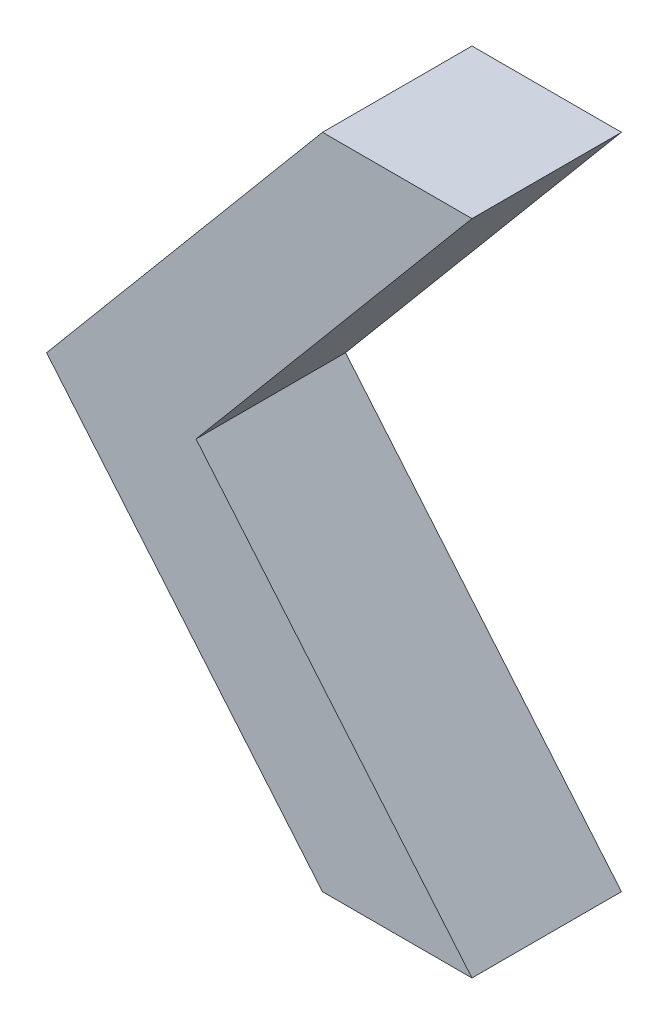
ISO-10303-21;
HEADER;
FILE_DESCRIPTION(('STEP AP214'),'2;1');
FILE_NAME('part.step','',(''),(''),'','','');
FILE_SCHEMA(('AUTOMOTIVE_DESIGN { 1 0 10303 214 1 1 1 1 }'));
ENDSEC;
DATA;
#1=APPLICATION_CONTEXT('core data for automotive mechanical design processes');
#2=APPLICATION_PROTOCOL_DEFINITION('international standard','automotive_design',2000,#1);
#3=PRODUCT_CONTEXT('',#1,'mechanical');
#4=PRODUCT('Part','Part','',(#3));
#5=PRODUCT_RELATED_PRODUCT_CATEGORY('part','',(#4));
#6=PRODUCT_DEFINITION_FORMATION('','',#4);
#7=PRODUCT_DEFINITION_CONTEXT('part definition',#1,'design');
#8=PRODUCT_DEFINITION('design','',#6,#7);
#9=PRODUCT_DEFINITION_SHAPE('','',#8);
#10=(LENGTH_UNIT() NAMED_UNIT(*) SI_UNIT(.MILLI.,.METRE.));
#11=(NAMED_UNIT(*) PLANE_ANGLE_UNIT() SI_UNIT($,.RADIAN.));
#12=(NAMED_UNIT(*) SI_UNIT($,.STERADIAN.) SOLID_ANGLE_UNIT());
#13=UNCERTAINTY_MEASURE_WITH_UNIT(LENGTH_MEASURE(1.E-05),#10,'distance_accuracy_value','');
#14=(GEOMETRIC_REPRESENTATION_CONTEXT(3) GLOBAL_UNCERTAINTY_ASSIGNED_CONTEXT((#13)) GLOBAL_UNIT_ASSIGNED_CONTEXT((#10,
#11,#12)) REPRESENTATION_CONTEXT('',''));
#15=CARTESIAN_POINT('',(0.,0.,0.));
#16=DIRECTION('',(0.,0.,1.));
#17=DIRECTION('',(1.,0.,0.));
#18=AXIS2_PLACEMENT_3D('',#15,#16,#17);
#19=CARTESIAN_POINT('',(0.,0.,12.5));
#20=DIRECTION('',(0.,-1.,0.));
#21=DIRECTION('',(0.,0.,-1.));
#22=AXIS2_PLACEMENT_3D('',#19,#20,#21);
#23=PLANE('',#22);
#24=DIRECTION('',(-1.,0.,0.));
#25=VECTOR('',#24,1.);
#26=CARTESIAN_POINT('',(0.,0.,0.));
#27=LINE('',#26,#25);
#28=CARTESIAN_POINT('',(12.5,0.,0.));
#29=VERTEX_POINT('',#28);
#30=CARTESIAN_POINT('',(0.,0.,0.));
#31=VERTEX_POINT('',#30);
#32=EDGE_CURVE('E128',#29,#31,#27,.T.);
#33=ORIENTED_EDGE('',*,*,#32,.T.);
#34=DIRECTION('',(0.,0.,-1.));
#35=VECTOR('',#34,1.);
#36=CARTESIAN_POINT('',(0.,0.,12.5));
#37=LINE('',#36,#35);
#38=CARTESIAN_POINT('',(0.,0.,12.5));
#39=VERTEX_POINT('',#38);
#40=EDGE_CURVE('E11',#39,#31,#37,.T.);
#41=ORIENTED_EDGE('',*,*,#40,.F.);
#42=DIRECTION('',(-1.,0.,0.));
#43=VECTOR('',#42,1.);
#44=CARTESIAN_POINT('',(0.,0.,12.5));
#45=LINE('',#44,#43);
#46=CARTESIAN_POINT('',(12.5,0.,12.5));
#47=VERTEX_POINT('',#46);
#48=EDGE_CURVE('E144',#47,#39,#45,.T.);
#49=ORIENTED_EDGE('',*,*,#48,.F.);
#50=DIRECTION('',(0.,0.,-1.));
#51=VECTOR('',#50,1.);
#52=CARTESIAN_POINT('',(12.5,0.,12.5));
#53=LINE('',#52,#51);
#54=EDGE_CURVE('E124',#47,#29,#53,.T.);
#55=ORIENTED_EDGE('',*,*,#54,.T.);
#56=EDGE_LOOP('',(#33,#41,#49,#55));
#57=FACE_BOUND('',#56,.T.);
#58=ADVANCED_FACE('F39',(#57),#23,.F.);
#59=CARTESIAN_POINT('',(0.,0.,12.5));
#60=DIRECTION('',(0.766044443118977,-0.642787609686541,0.));
#61=DIRECTION('',(0.642787609686541,0.766044443118977,0.));
#62=AXIS2_PLACEMENT_3D('',#59,#60,#61);
#63=PLANE('',#62);
#64=DIRECTION('',(-0.642787609686541,-0.766044443118977,0.));
#65=VECTOR('',#64,1.);
#66=CARTESIAN_POINT('',(0.,0.,0.));
#67=LINE('',#66,#65);
#68=CARTESIAN_POINT('',(-23.0752398573753,-27.5,0.));
#69=VERTEX_POINT('',#68);
#70=EDGE_CURVE('E132',#31,#69,#67,.T.);
#71=ORIENTED_EDGE('',*,*,#70,.T.);
#72=DIRECTION('',(0.,0.,-1.));
#73=VECTOR('',#72,1.);
#74=CARTESIAN_POINT('',(-23.0752398573753,-27.5,12.5));
#75=LINE('',#74,#73);
#76=CARTESIAN_POINT('',(-23.0752398573753,-27.5,12.5));
#77=VERTEX_POINT('',#76);
#78=EDGE_CURVE('E48',#77,#69,#75,.T.);
#79=ORIENTED_EDGE('',*,*,#78,.F.);
#80=DIRECTION('',(-0.642787609686541,-0.766044443118977,0.));
#81=VECTOR('',#80,1.);
#82=CARTESIAN_POINT('',(0.,0.,12.5));
#83=LINE('',#82,#81);
#84=EDGE_CURVE('E93',#39,#77,#83,.T.);
#85=ORIENTED_EDGE('',*,*,#84,.F.);
#86=ORIENTED_EDGE('',*,*,#40,.T.);
#87=EDGE_LOOP('',(#71,#79,#85,#86));
#88=FACE_BOUND('',#87,.T.);
#89=ADVANCED_FACE('F172',(#88),#63,.F.);
#90=CARTESIAN_POINT('',(-23.0752398573753,-27.5,12.5));
#91=DIRECTION('',(0.766044443118977,0.64278760968654,0.));
#92=DIRECTION('',(-0.64278760968654,0.766044443118977,0.));
#93=AXIS2_PLACEMENT_3D('',#90,#91,#92);
#94=PLANE('',#93);
#95=DIRECTION('',(0.64278760968654,-0.766044443118977,0.));
#96=VECTOR('',#95,1.);
#97=CARTESIAN_POINT('',(-23.0752398573753,-27.5,0.));
#98=LINE('',#97,#96);
#99=CARTESIAN_POINT('',(0.,-55.,0.));
#100=VERTEX_POINT('',#99);
#101=EDGE_CURVE('E135',#69,#100,#98,.T.);
#102=ORIENTED_EDGE('',*,*,#101,.T.);
#103=DIRECTION('',(0.,0.,-1.));
#104=VECTOR('',#103,1.);
#105=CARTESIAN_POINT('',(0.,-55.,12.5));
#106=LINE('',#105,#104);
#107=CARTESIAN_POINT('',(0.,-55.,12.5));
#108=VERTEX_POINT('',#107);
#109=EDGE_CURVE('E117',#108,#100,#106,.T.);
#110=ORIENTED_EDGE('',*,*,#109,.F.);
#111=DIRECTION('',(0.64278760968654,-0.766044443118977,0.));
#112=VECTOR('',#111,1.);
#113=CARTESIAN_POINT('',(-23.0752398573753,-27.5,12.5));
#114=LINE('',#113,#112);
#115=EDGE_CURVE('E106',#77,#108,#114,.T.);
#116=ORIENTED_EDGE('',*,*,#115,.F.);
#117=ORIENTED_EDGE('',*,*,#78,.T.);
#118=EDGE_LOOP('',(#102,#110,#116,#117));
#119=FACE_BOUND('',#118,.T.);
#120=ADVANCED_FACE('F154',(#119),#94,.F.);
#121=CARTESIAN_POINT('',(0.,-55.,12.5));
#122=DIRECTION('',(0.,1.,0.));
#123=DIRECTION('',(0.,0.,1.));
#124=AXIS2_PLACEMENT_3D('',#121,#122,#123);
#125=PLANE('',#124);
#126=DIRECTION('',(1.,0.,0.));
#127=VECTOR('',#126,1.);
#128=CARTESIAN_POINT('',(0.,-55.,0.));
#129=LINE('',#128,#127);
#130=CARTESIAN_POINT('',(12.5,-55.,0.));
#131=VERTEX_POINT('',#130);
#132=EDGE_CURVE('E115',#100,#131,#129,.T.);
#133=ORIENTED_EDGE('',*,*,#132,.T.);
#134=DIRECTION('',(0.,0.,-1.));
#135=VECTOR('',#134,1.);
#136=CARTESIAN_POINT('',(12.5,-55.,12.5));
#137=LINE('',#136,#135);
#138=CARTESIAN_POINT('',(12.5,-55.,12.5));
#139=VERTEX_POINT('',#138);
#140=EDGE_CURVE('E112',#139,#131,#137,.T.);
#141=ORIENTED_EDGE('',*,*,#140,.F.);
#142=DIRECTION('',(1.,0.,0.));
#143=VECTOR('',#142,1.);
#144=CARTESIAN_POINT('',(0.,-55.,12.5));
#145=LINE('',#144,#143);
#146=EDGE_CURVE('E100',#108,#139,#145,.T.);
#147=ORIENTED_EDGE('',*,*,#146,.F.);
#148=ORIENTED_EDGE('',*,*,#109,.T.);
#149=EDGE_LOOP('',(#133,#141,#147,#148));
#150=FACE_BOUND('',#149,.T.);
#151=ADVANCED_FACE('F113',(#150),#125,.F.);
#152=CARTESIAN_POINT('',(-10.5752398573753,-27.5,12.5));
#153=DIRECTION('',(-0.766044443118977,-0.64278760968654,0.));
#154=DIRECTION('',(0.64278760968654,-0.766044443118977,0.));
#155=AXIS2_PLACEMENT_3D('',#152,#153,#154);
#156=PLANE('',#155);
#157=DIRECTION('',(-0.64278760968654,0.766044443118977,0.));
#158=VECTOR('',#157,1.);
#159=CARTESIAN_POINT('',(-10.5752398573753,-27.5,0.));
#160=LINE('',#159,#158);
#161=CARTESIAN_POINT('',(-10.5752398573753,-27.5,0.));
#162=VERTEX_POINT('',#161);
#163=EDGE_CURVE('E79',#131,#162,#160,.T.);
#164=ORIENTED_EDGE('',*,*,#163,.T.);
#165=DIRECTION('',(0.,0.,-1.));
#166=VECTOR('',#165,1.);
#167=CARTESIAN_POINT('',(-10.5752398573753,-27.5,12.5));
#168=LINE('',#167,#166);
#169=CARTESIAN_POINT('',(-10.5752398573753,-27.5,12.5));
#170=VERTEX_POINT('',#169);
#171=EDGE_CURVE('E118',#170,#162,#168,.T.);
#172=ORIENTED_EDGE('',*,*,#171,.F.);
#173=DIRECTION('',(-0.64278760968654,0.766044443118977,0.));
#174=VECTOR('',#173,1.);
#175=CARTESIAN_POINT('',(-10.5752398573753,-27.5,12.5));
#176=LINE('',#175,#174);
#177=EDGE_CURVE('E104',#139,#170,#176,.T.);
#178=ORIENTED_EDGE('',*,*,#177,.F.);
#179=ORIENTED_EDGE('',*,*,#140,.T.);
#180=EDGE_LOOP('',(#164,#172,#178,#179));
#181=FACE_BOUND('',#180,.T.);
#182=ADVANCED_FACE('F120',(#181),#156,.F.);
#183=CARTESIAN_POINT('',(12.5,0.,12.5));
#184=DIRECTION('',(-0.766044443118977,0.642787609686541,0.));
#185=DIRECTION('',(-0.642787609686541,-0.766044443118977,0.));
#186=AXIS2_PLACEMENT_3D('',#183,#184,#185);
#187=PLANE('',#186);
#188=DIRECTION('',(0.642787609686541,0.766044443118977,0.));
#189=VECTOR('',#188,1.);
#190=CARTESIAN_POINT('',(12.5,0.,0.));
#191=LINE('',#190,#189);
#192=EDGE_CURVE('E85',#162,#29,#191,.T.);
#193=ORIENTED_EDGE('',*,*,#192,.T.);
#194=ORIENTED_EDGE('',*,*,#54,.F.);
#195=DIRECTION('',(0.642787609686541,0.766044443118977,0.));
#196=VECTOR('',#195,1.);
#197=CARTESIAN_POINT('',(12.5,0.,12.5));
#198=LINE('',#197,#196);
#199=EDGE_CURVE('E56',#170,#47,#198,.T.);
#200=ORIENTED_EDGE('',*,*,#199,.F.);
#201=ORIENTED_EDGE('',*,*,#171,.T.);
#202=EDGE_LOOP('',(#193,#194,#200,#201));
#203=FACE_BOUND('',#202,.T.);
#204=ADVANCED_FACE('F161',(#203),#187,.F.);
#205=CARTESIAN_POINT('',(0.,0.,12.5));
#206=DIRECTION('',(0.,0.,-1.));
#207=DIRECTION('',(-1.,0.,0.));
#208=AXIS2_PLACEMENT_3D('',#205,#206,#207);
#209=PLANE('',#208);
#210=ORIENTED_EDGE('',*,*,#48,.T.);
#211=ORIENTED_EDGE('',*,*,#84,.T.);
#212=ORIENTED_EDGE('',*,*,#115,.T.);
#213=ORIENTED_EDGE('',*,*,#146,.T.);
#214=ORIENTED_EDGE('',*,*,#177,.T.);
#215=ORIENTED_EDGE('',*,*,#199,.T.);
#216=EDGE_LOOP('',(#210,#211,#212,#213,#214,#215));
#217=FACE_BOUND('',#216,.T.);
#218=ADVANCED_FACE('F102',(#217),#209,.F.);
#219=CARTESIAN_POINT('',(0.,0.,0.));
#220=DIRECTION('',(0.,0.,-1.));
#221=DIRECTION('',(-1.,0.,0.));
#222=AXIS2_PLACEMENT_3D('',#219,#220,#221);
#223=PLANE('',#222);
#224=ORIENTED_EDGE('',*,*,#32,.F.);
#225=ORIENTED_EDGE('',*,*,#192,.F.);
#226=ORIENTED_EDGE('',*,*,#163,.F.);
#227=ORIENTED_EDGE('',*,*,#132,.F.);
#228=ORIENTED_EDGE('',*,*,#101,.F.);
#229=ORIENTED_EDGE('',*,*,#70,.F.);
#230=EDGE_LOOP('',(#224,#225,#226,#227,#228,#229));
#231=FACE_BOUND('',#230,.T.);
#232=ADVANCED_FACE('F157',(#231),#223,.T.);
#233=CLOSED_SHELL('',(#58,#89,#120,#151,#182,#204,#218,#232));
#234=MANIFOLD_SOLID_BREP('B2',#233);
#235=ADVANCED_BREP_SHAPE_REPRESENTATION('',(#18,#234),#14);
#236=SHAPE_DEFINITION_REPRESENTATION(#9,#235);
ENDSEC;
END-ISO-10303-21;
